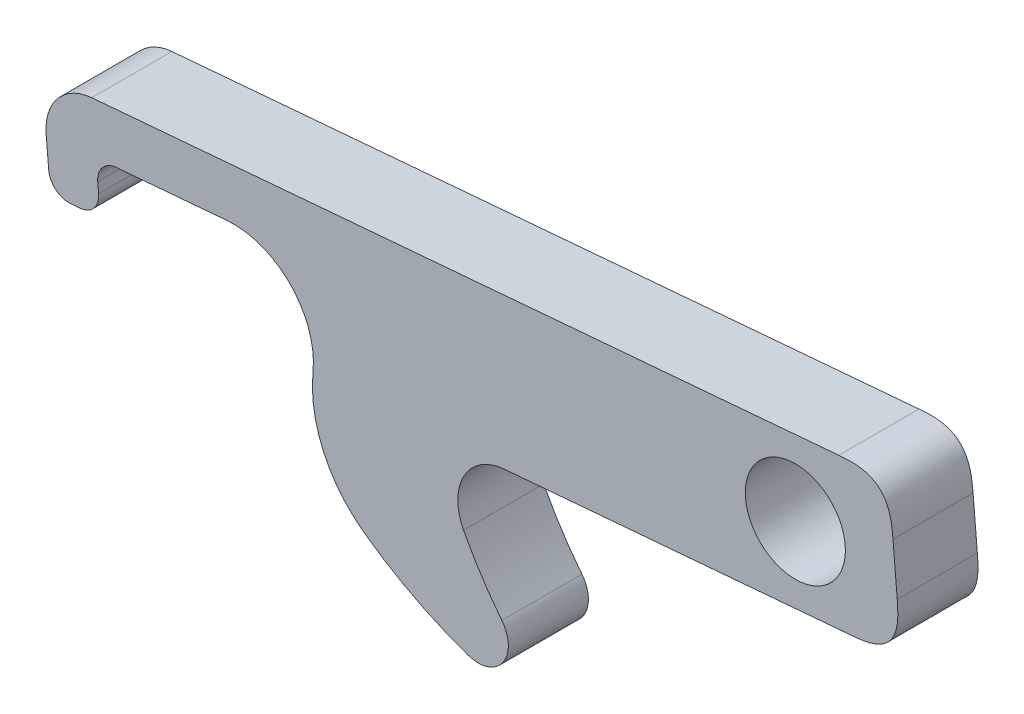
ISO-10303-21;
HEADER;
FILE_DESCRIPTION(('STEP AP214'),'2;1');
FILE_NAME('part.step','',(''),(''),'','','');
FILE_SCHEMA(('AUTOMOTIVE_DESIGN { 1 0 10303 214 1 1 1 1 }'));
ENDSEC;
DATA;
#1=APPLICATION_CONTEXT('core data for automotive mechanical design processes');
#2=APPLICATION_PROTOCOL_DEFINITION('international standard','automotive_design',2000,#1);
#3=PRODUCT_CONTEXT('',#1,'mechanical');
#4=PRODUCT('Part','Part','',(#3));
#5=PRODUCT_RELATED_PRODUCT_CATEGORY('part','',(#4));
#6=PRODUCT_DEFINITION_FORMATION('','',#4);
#7=PRODUCT_DEFINITION_CONTEXT('part definition',#1,'design');
#8=PRODUCT_DEFINITION('design','',#6,#7);
#9=PRODUCT_DEFINITION_SHAPE('','',#8);
#10=(LENGTH_UNIT() NAMED_UNIT(*) SI_UNIT(.MILLI.,.METRE.));
#11=(NAMED_UNIT(*) PLANE_ANGLE_UNIT() SI_UNIT($,.RADIAN.));
#12=(NAMED_UNIT(*) SI_UNIT($,.STERADIAN.) SOLID_ANGLE_UNIT());
#13=UNCERTAINTY_MEASURE_WITH_UNIT(LENGTH_MEASURE(1.E-05),#10,'distance_accuracy_value','');
#14=(GEOMETRIC_REPRESENTATION_CONTEXT(3) GLOBAL_UNCERTAINTY_ASSIGNED_CONTEXT((#13)) GLOBAL_UNIT_ASSIGNED_CONTEXT((#10,
#11,#12)) REPRESENTATION_CONTEXT('',''));
#15=CARTESIAN_POINT('',(0.,0.,0.));
#16=DIRECTION('',(0.,0.,1.));
#17=DIRECTION('',(1.,0.,0.));
#18=AXIS2_PLACEMENT_3D('',#15,#16,#17);
#19=CARTESIAN_POINT('',(-28.7078,-15.,-8.00000000000001));
#20=DIRECTION('',(0.,0.,1.));
#21=DIRECTION('',(1.,0.,0.));
#22=AXIS2_PLACEMENT_3D('',#19,#20,#21);
#23=CYLINDRICAL_SURFACE('',#22,5.);
#24=CARTESIAN_POINT('',(-28.7078,-15.,0.));
#25=DIRECTION('',(0.,0.,-1.));
#26=DIRECTION('',(1.,0.,0.));
#27=AXIS2_PLACEMENT_3D('',#24,#25,#26);
#28=CIRCLE('',#27,5.);
#29=CARTESIAN_POINT('',(-33.1393295835851,-17.3155011444199,0.));
#30=VERTEX_POINT('',#29);
#31=CARTESIAN_POINT('',(-29.1337255559148,-10.018174288394,0.));
#32=VERTEX_POINT('',#31);
#33=EDGE_CURVE('E468',#30,#32,#28,.T.);
#34=ORIENTED_EDGE('',*,*,#33,.F.);
#35=DIRECTION('',(0.,0.,1.));
#36=VECTOR('',#35,1.);
#37=CARTESIAN_POINT('',(-33.1393295835851,-17.3155011444198,-8.00000000000001));
#38=LINE('',#37,#36);
#39=CARTESIAN_POINT('',(-33.1393295835851,-17.3155011444198,-8.00000000000001));
#40=VERTEX_POINT('',#39);
#41=EDGE_CURVE('E204',#40,#30,#38,.T.);
#42=ORIENTED_EDGE('',*,*,#41,.F.);
#43=CARTESIAN_POINT('',(-28.7078,-15.,-8.00000000000001));
#44=DIRECTION('',(0.,0.,-1.));
#45=DIRECTION('',(1.,0.,0.));
#46=AXIS2_PLACEMENT_3D('',#43,#44,#45);
#47=CIRCLE('',#46,5.);
#48=CARTESIAN_POINT('',(-29.1337255559148,-10.018174288394,-7.99999999999995));
#49=VERTEX_POINT('',#48);
#50=EDGE_CURVE('E195',#40,#49,#47,.T.);
#51=ORIENTED_EDGE('',*,*,#50,.T.);
#52=DIRECTION('',(0.,0.,1.));
#53=VECTOR('',#52,1.);
#54=CARTESIAN_POINT('',(-29.1337255559148,-10.018174288394,-7.99999999999995));
#55=LINE('',#54,#53);
#56=EDGE_CURVE('E174',#49,#32,#55,.T.);
#57=ORIENTED_EDGE('',*,*,#56,.T.);
#58=EDGE_LOOP('',(#34,#42,#51,#57));
#59=FACE_BOUND('',#58,.T.);
#60=ADVANCED_FACE('F44',(#59),#23,.F.);
#61=CARTESIAN_POINT('',(0.,0.,-8.00000000000001));
#62=DIRECTION('',(0.,0.,1.));
#63=DIRECTION('',(1.,0.,0.));
#64=AXIS2_PLACEMENT_3D('',#61,#62,#63);
#65=CYLINDRICAL_SURFACE('',#64,37.3903964291887);
#66=CARTESIAN_POINT('',(0.,0.,0.));
#67=DIRECTION('',(0.,0.,-1.));
#68=DIRECTION('',(1.,0.,0.));
#69=AXIS2_PLACEMENT_3D('',#66,#67,#68);
#70=CIRCLE('',#69,37.3903964291887);
#71=CARTESIAN_POINT('',(-29.3122779694776,-23.2127573840758,0.));
#72=VERTEX_POINT('',#71);
#73=EDGE_CURVE('E206',#72,#30,#70,.T.);
#74=ORIENTED_EDGE('',*,*,#73,.F.);
#75=DIRECTION('',(0.,0.,1.));
#76=VECTOR('',#75,1.);
#77=CARTESIAN_POINT('',(-29.3122779694776,-23.2127573840758,-8.00000000000001));
#78=LINE('',#77,#76);
#79=CARTESIAN_POINT('',(-29.3122779694776,-23.2127573840758,-8.00000000000001));
#80=VERTEX_POINT('',#79);
#81=EDGE_CURVE('E429',#80,#72,#78,.T.);
#82=ORIENTED_EDGE('',*,*,#81,.F.);
#83=CARTESIAN_POINT('',(0.,0.,-8.00000000000001));
#84=DIRECTION('',(0.,0.,-1.));
#85=DIRECTION('',(1.,0.,0.));
#86=AXIS2_PLACEMENT_3D('',#83,#84,#85);
#87=CIRCLE('',#86,37.3903964291887);
#88=EDGE_CURVE('E188',#80,#40,#87,.T.);
#89=ORIENTED_EDGE('',*,*,#88,.T.);
#90=ORIENTED_EDGE('',*,*,#41,.T.);
#91=EDGE_LOOP('',(#74,#82,#89,#90));
#92=FACE_BOUND('',#91,.T.);
#93=ADVANCED_FACE('F247',(#92),#65,.F.);
#94=CARTESIAN_POINT('',(-31.6641341225668,-25.0752215139791,-8.00000000000001));
#95=DIRECTION('',(0.,0.,1.));
#96=DIRECTION('',(1.,0.,0.));
#97=AXIS2_PLACEMENT_3D('',#94,#95,#96);
#98=CYLINDRICAL_SURFACE('',#97,3.);
#99=CARTESIAN_POINT('',(-31.6641341225668,-25.0752215139791,0.));
#100=DIRECTION('',(0.,0.,1.));
#101=DIRECTION('',(1.,0.,0.));
#102=AXIS2_PLACEMENT_3D('',#99,#100,#101);
#103=CIRCLE('',#102,3.);
#104=CARTESIAN_POINT('',(-32.6413980189783,-27.9115845508223,0.));
#105=VERTEX_POINT('',#104);
#106=EDGE_CURVE('E211',#105,#72,#103,.T.);
#107=ORIENTED_EDGE('',*,*,#106,.F.);
#108=DIRECTION('',(0.,0.,1.));
#109=VECTOR('',#108,1.);
#110=CARTESIAN_POINT('',(-32.6413980189783,-27.9115845508223,-8.00000000000001));
#111=LINE('',#110,#109);
#112=CARTESIAN_POINT('',(-32.6413980189783,-27.9115845508223,-8.00000000000001));
#113=VERTEX_POINT('',#112);
#114=EDGE_CURVE('E433',#113,#105,#111,.T.);
#115=ORIENTED_EDGE('',*,*,#114,.F.);
#116=CARTESIAN_POINT('',(-31.6641341225668,-25.0752215139791,-8.00000000000001));
#117=DIRECTION('',(0.,0.,1.));
#118=DIRECTION('',(1.,0.,0.));
#119=AXIS2_PLACEMENT_3D('',#116,#117,#118);
#120=CIRCLE('',#119,3.);
#121=EDGE_CURVE('E444',#113,#80,#120,.T.);
#122=ORIENTED_EDGE('',*,*,#121,.T.);
#123=ORIENTED_EDGE('',*,*,#81,.T.);
#124=EDGE_LOOP('',(#107,#115,#122,#123));
#125=FACE_BOUND('',#124,.T.);
#126=ADVANCED_FACE('F627',(#125),#98,.T.);
#127=CARTESIAN_POINT('',(-19.611212733492,9.90658927375435,-8.00000000000001));
#128=DIRECTION('',(0.,0.,1.));
#129=DIRECTION('',(1.,0.,0.));
#130=AXIS2_PLACEMENT_3D('',#127,#128,#129);
#131=CYLINDRICAL_SURFACE('',#130,40.);
#132=CARTESIAN_POINT('',(-19.611212733492,9.90658927375435,0.));
#133=DIRECTION('',(0.,0.,1.));
#134=DIRECTION('',(1.,0.,0.));
#135=AXIS2_PLACEMENT_3D('',#132,#133,#134);
#136=CIRCLE('',#135,40.);
#137=CARTESIAN_POINT('',(-43.0603085295121,-22.4992729482121,0.));
#138=VERTEX_POINT('',#137);
#139=EDGE_CURVE('E525',#138,#105,#136,.T.);
#140=ORIENTED_EDGE('',*,*,#139,.F.);
#141=DIRECTION('',(0.,0.,1.));
#142=VECTOR('',#141,1.);
#143=CARTESIAN_POINT('',(-43.0603085295122,-22.499272948212,-8.00000000000001));
#144=LINE('',#143,#142);
#145=CARTESIAN_POINT('',(-43.0603085295122,-22.499272948212,-8.00000000000001));
#146=VERTEX_POINT('',#145);
#147=EDGE_CURVE('E187',#146,#138,#144,.T.);
#148=ORIENTED_EDGE('',*,*,#147,.F.);
#149=CARTESIAN_POINT('',(-19.611212733492,9.90658927375435,-8.00000000000001));
#150=DIRECTION('',(0.,0.,1.));
#151=DIRECTION('',(1.,0.,0.));
#152=AXIS2_PLACEMENT_3D('',#149,#150,#151);
#153=CIRCLE('',#152,40.);
#154=EDGE_CURVE('E449',#146,#113,#153,.T.);
#155=ORIENTED_EDGE('',*,*,#154,.T.);
#156=ORIENTED_EDGE('',*,*,#114,.T.);
#157=EDGE_LOOP('',(#140,#148,#155,#156));
#158=FACE_BOUND('',#157,.T.);
#159=ADVANCED_FACE('F625',(#158),#131,.T.);
#160=CARTESIAN_POINT('',(-35.7324660932558,-12.3724410038475,-7.99999999999995));
#161=DIRECTION('',(0.,0.,1.));
#162=DIRECTION('',(1.,0.,0.));
#163=AXIS2_PLACEMENT_3D('',#160,#161,#162);
#164=CYLINDRICAL_SURFACE('',#163,12.5);
#165=CARTESIAN_POINT('',(-35.7324660932558,-12.3724410038476,0.));
#166=DIRECTION('',(0.,0.,1.));
#167=DIRECTION('',(1.,0.,0.));
#168=AXIS2_PLACEMENT_3D('',#165,#166,#167);
#169=CIRCLE('',#168,12.5);
#170=CARTESIAN_POINT('',(-48.1695914210683,-11.1202774441292,0.));
#171=VERTEX_POINT('',#170);
#172=EDGE_CURVE('E477',#171,#138,#169,.T.);
#173=ORIENTED_EDGE('',*,*,#172,.F.);
#174=DIRECTION('',(0.,0.,1.));
#175=VECTOR('',#174,1.);
#176=CARTESIAN_POINT('',(-48.1695914210683,-11.1202774441293,-8.00000000000001));
#177=LINE('',#176,#175);
#178=CARTESIAN_POINT('',(-48.1695914210683,-11.1202774441293,-8.00000000000001));
#179=VERTEX_POINT('',#178);
#180=EDGE_CURVE('E60',#171,#179,#177,.F.);
#181=ORIENTED_EDGE('',*,*,#180,.T.);
#182=CARTESIAN_POINT('',(-35.7324660932558,-12.3724410038475,-7.99999999999995));
#183=DIRECTION('',(0.,0.,1.));
#184=DIRECTION('',(1.,0.,0.));
#185=AXIS2_PLACEMENT_3D('',#182,#183,#184);
#186=CIRCLE('',#185,12.5);
#187=EDGE_CURVE('E454',#179,#146,#186,.T.);
#188=ORIENTED_EDGE('',*,*,#187,.T.);
#189=ORIENTED_EDGE('',*,*,#147,.T.);
#190=EDGE_LOOP('',(#173,#181,#188,#189));
#191=FACE_BOUND('',#190,.T.);
#192=ADVANCED_FACE('F622',(#191),#164,.T.);
#193=CARTESIAN_POINT('',(9.32476308933986,8.32458967923855,-7.99999999999995));
#194=DIRECTION('',(-0.0851851111829553,0.996365142321201,0.));
#195=DIRECTION('',(-0.996365142321201,-0.0851851111829553,0.));
#196=AXIS2_PLACEMENT_3D('',#193,#194,#195);
#197=PLANE('',#196);
#198=DIRECTION('',(-0.996365142321201,-0.0851851111829553,0.));
#199=VECTOR('',#198,1.);
#200=CARTESIAN_POINT('',(9.32476308933986,8.32458967923855,-7.99999999999995));
#201=LINE('',#200,#199);
#202=CARTESIAN_POINT('',(4.34293737773385,7.8986641233238,-7.99999999999995));
#203=VERTEX_POINT('',#202);
#204=CARTESIAN_POINT('',(-70.2661079165071,1.5198983991058,-8.00000000000001));
#205=VERTEX_POINT('',#204);
#206=EDGE_CURVE('E458',#203,#205,#201,.T.);
#207=ORIENTED_EDGE('',*,*,#206,.T.);
#208=DIRECTION('',(0.,0.,1.));
#209=VECTOR('',#208,1.);
#210=CARTESIAN_POINT('',(-70.2661079165071,1.5198983991058,-8.00000000000001));
#211=LINE('',#210,#209);
#212=CARTESIAN_POINT('',(-70.2661079165071,1.5198983991058,0.));
#213=VERTEX_POINT('',#212);
#214=EDGE_CURVE('E342',#205,#213,#211,.T.);
#215=ORIENTED_EDGE('',*,*,#214,.T.);
#216=DIRECTION('',(-0.996365142321201,-0.0851851111829553,0.));
#217=VECTOR('',#216,1.);
#218=CARTESIAN_POINT('',(9.32476308933986,8.32458967923855,0.));
#219=LINE('',#218,#217);
#220=CARTESIAN_POINT('',(4.34293737773385,7.8986641233238,0.));
#221=VERTEX_POINT('',#220);
#222=EDGE_CURVE('E473',#221,#213,#219,.T.);
#223=ORIENTED_EDGE('',*,*,#222,.F.);
#224=CARTESIAN_POINT('',(4.34293737773385,7.89866412332382,-8.39999999999991));
#225=CARTESIAN_POINT('',(4.34293737773385,7.89866412332385,-5.46666666666884));
#226=CARTESIAN_POINT('',(4.34293737773385,7.8986641233238,-2.53333333333328));
#227=CARTESIAN_POINT('',(4.34293737773385,7.8986641233238,0.400000000000067));
#228=B_SPLINE_CURVE_WITH_KNOTS('',3,(#224,#225,#226,#227),.UNSPECIFIED.,.F.,.F.,(4,4),(-0.0004,
0.0084),.UNSPECIFIED.);
#229=EDGE_CURVE('E338',#221,#203,#228,.F.);
#230=ORIENTED_EDGE('',*,*,#229,.T.);
#231=EDGE_LOOP('',(#207,#215,#223,#230));
#232=FACE_BOUND('',#231,.T.);
#233=ADVANCED_FACE('F613',(#232),#197,.T.);
#234=CARTESIAN_POINT('',(10.6025397570842,-6.62088745557943,-7.99999999999995));
#235=DIRECTION('',(0.996365142321201,0.0851851111829548,0.));
#236=DIRECTION('',(-0.0851851111829548,0.996365142321201,0.));
#237=AXIS2_PLACEMENT_3D('',#234,#235,#236);
#238=PLANE('',#237);
#239=DIRECTION('',(-0.0851851111829548,0.996365142321201,0.));
#240=VECTOR('',#239,1.);
#241=CARTESIAN_POINT('',(10.6025397570842,-6.62088745557945,0.));
#242=LINE('',#241,#240);
#243=CARTESIAN_POINT('',(10.1766142011694,-1.63906174397346,0.));
#244=VERTEX_POINT('',#243);
#245=CARTESIAN_POINT('',(9.75068864525464,3.34276396763256,0.));
#246=VERTEX_POINT('',#245);
#247=EDGE_CURVE('E230',#244,#246,#242,.T.);
#248=ORIENTED_EDGE('',*,*,#247,.F.);
#249=CARTESIAN_POINT('',(10.1766142011694,-1.63906174397346,-8.39999999999996));
#250=CARTESIAN_POINT('',(10.1766142011694,-1.63906174397344,-5.4666666666689));
#251=CARTESIAN_POINT('',(10.1766142011694,-1.63906174397346,-2.53333333333333));
#252=CARTESIAN_POINT('',(10.1766142011694,-1.63906174397346,0.400000000000011));
#253=B_SPLINE_CURVE_WITH_KNOTS('',3,(#249,#250,#251,#252),.UNSPECIFIED.,.F.,.F.,(4,4),(-0.0004,
0.0084),.UNSPECIFIED.);
#254=CARTESIAN_POINT('',(10.1766142011694,-1.63906174397346,-8.00000000000001));
#255=VERTEX_POINT('',#254);
#256=EDGE_CURVE('E293',#244,#255,#253,.F.);
#257=ORIENTED_EDGE('',*,*,#256,.T.);
#258=DIRECTION('',(-0.0851851111829548,0.996365142321201,0.));
#259=VECTOR('',#258,1.);
#260=CARTESIAN_POINT('',(10.6025397570842,-6.62088745557943,-7.99999999999995));
#261=LINE('',#260,#259);
#262=CARTESIAN_POINT('',(9.75068864525463,3.34276396763258,-8.00000000000001));
#263=VERTEX_POINT('',#262);
#264=EDGE_CURVE('E202',#255,#263,#261,.T.);
#265=ORIENTED_EDGE('',*,*,#264,.T.);
#266=CARTESIAN_POINT('',(9.75068864525463,3.34276396763258,0.400000000000011));
#267=CARTESIAN_POINT('',(9.75068864525463,3.34276396763258,-2.53333333333333));
#268=CARTESIAN_POINT('',(9.75068864525463,3.34276396763261,-5.4666666666689));
#269=CARTESIAN_POINT('',(9.75068864525463,3.34276396763258,-8.40000000000002));
#270=B_SPLINE_CURVE_WITH_KNOTS('',3,(#266,#267,#268,#269),.UNSPECIFIED.,.F.,.F.,(4,4),
(-0.000399999999999999,0.0084),.UNSPECIFIED.);
#271=EDGE_CURVE('E318',#263,#246,#270,.F.);
#272=ORIENTED_EDGE('',*,*,#271,.T.);
#273=EDGE_LOOP('',(#248,#257,#265,#272));
#274=FACE_BOUND('',#273,.T.);
#275=ADVANCED_FACE('F242',(#274),#238,.T.);
#276=CARTESIAN_POINT('',(-29.1337255559148,-10.018174288394,-7.99999999999995));
#277=DIRECTION('',(0.0851851111829544,-0.996365142321201,0.));
#278=DIRECTION('',(0.996365142321201,0.0851851111829544,0.));
#279=AXIS2_PLACEMENT_3D('',#276,#277,#278);
#280=PLANE('',#279);
#281=DIRECTION('',(0.996365142321201,0.0851851111829544,0.));
#282=VECTOR('',#281,1.);
#283=CARTESIAN_POINT('',(-29.1337255559148,-10.018174288394,-7.99999999999995));
#284=LINE('',#283,#282);
#285=CARTESIAN_POINT('',(5.62071404547816,-7.04681301149426,-7.99999999999995));
#286=VERTEX_POINT('',#285);
#287=EDGE_CURVE('E178',#49,#286,#284,.T.);
#288=ORIENTED_EDGE('',*,*,#287,.T.);
#289=CARTESIAN_POINT('',(5.62071404547817,-7.04681301149424,0.400000000000067));
#290=CARTESIAN_POINT('',(5.62071404547817,-7.04681301149424,-2.53333333333328));
#291=CARTESIAN_POINT('',(5.62071404547818,-7.04681301149421,-5.46666666666884));
#292=CARTESIAN_POINT('',(5.62071404547817,-7.04681301149426,-8.39999999999991));
#293=B_SPLINE_CURVE_WITH_KNOTS('',3,(#289,#290,#291,#292),.UNSPECIFIED.,.F.,.F.,(4,4),
(-0.000399999999999999,0.0084),.UNSPECIFIED.);
#294=CARTESIAN_POINT('',(5.62071404547816,-7.04681301149424,0.));
#295=VERTEX_POINT('',#294);
#296=EDGE_CURVE('E225',#286,#295,#293,.F.);
#297=ORIENTED_EDGE('',*,*,#296,.T.);
#298=DIRECTION('',(0.996365142321201,0.0851851111829544,0.));
#299=VECTOR('',#298,1.);
#300=CARTESIAN_POINT('',(-29.1337255559148,-10.018174288394,0.));
#301=LINE('',#300,#299);
#302=EDGE_CURVE('E181',#32,#295,#301,.T.);
#303=ORIENTED_EDGE('',*,*,#302,.F.);
#304=ORIENTED_EDGE('',*,*,#56,.F.);
#305=EDGE_LOOP('',(#288,#297,#303,#304));
#306=FACE_BOUND('',#305,.T.);
#307=ADVANCED_FACE('F176',(#306),#280,.T.);
#308=CARTESIAN_POINT('',(-28.7078,-15.,-8.00000000000001));
#309=DIRECTION('',(0.,0.,1.));
#310=DIRECTION('',(1.,0.,0.));
#311=AXIS2_PLACEMENT_3D('',#308,#309,#310);
#312=PLANE('',#311);
#313=CARTESIAN_POINT('',(0.,0.,-8.00000000000001));
#314=DIRECTION('',(0.,0.,1.));
#315=DIRECTION('',(1.,0.,0.));
#316=AXIS2_PLACEMENT_3D('',#313,#314,#315);
#317=CIRCLE('',#316,5.);
#318=CARTESIAN_POINT('',(5.,0.,-8.00000000000001));
#319=VERTEX_POINT('',#318);
#320=EDGE_CURVE('E471',#319,#319,#317,.T.);
#321=ORIENTED_EDGE('',*,*,#320,.T.);
#322=EDGE_LOOP('',(#321));
#323=FACE_BOUND('',#322,.T.);
#324=DIRECTION('',(0.0851851111829561,-0.996365142321201,0.));
#325=VECTOR('',#324,1.);
#326=CARTESIAN_POINT('',(-69.4142568046775,-8.44375302410621,-8.00000000000001));
#327=LINE('',#326,#325);
#328=CARTESIAN_POINT('',(-69.6698121382264,-5.45465759714264,-8.00000000000001));
#329=VERTEX_POINT('',#328);
#330=CARTESIAN_POINT('',(-69.5846270270435,-6.45102273946382,-7.99999999999995));
#331=VERTEX_POINT('',#330);
#332=EDGE_CURVE('E492',#329,#331,#327,.T.);
#333=ORIENTED_EDGE('',*,*,#332,.T.);
#334=CARTESIAN_POINT('',(-71.5773573116859,-6.6213929618297,-8.00000000000001));
#335=DIRECTION('',(0.,0.,1.));
#336=DIRECTION('',(1.,0.,0.));
#337=AXIS2_PLACEMENT_3D('',#334,#335,#336);
#338=CIRCLE('',#337,2.);
#339=CARTESIAN_POINT('',(-71.40698708932,-8.61412324647212,-7.99999999999995));
#340=VERTEX_POINT('',#339);
#341=EDGE_CURVE('E388',#331,#340,#338,.F.);
#342=ORIENTED_EDGE('',*,*,#341,.T.);
#343=DIRECTION('',(-0.996365142321201,-0.085185111182956,0.));
#344=VECTOR('',#343,1.);
#345=CARTESIAN_POINT('',(-74.3960825162835,-8.86967858002097,-7.99999999999995));
#346=LINE('',#345,#344);
#347=CARTESIAN_POINT('',(-72.4033522316412,-8.69930835765512,-8.00000000000001));
#348=VERTEX_POINT('',#347);
#349=EDGE_CURVE('E496',#340,#348,#346,.T.);
#350=ORIENTED_EDGE('',*,*,#349,.T.);
#351=CARTESIAN_POINT('',(-72.573722454007,-6.70657807301267,-8.00000000000001));
#352=DIRECTION('',(0.,0.,1.));
#353=DIRECTION('',(1.,0.,0.));
#354=AXIS2_PLACEMENT_3D('',#351,#352,#353);
#355=CIRCLE('',#354,2.);
#356=CARTESIAN_POINT('',(-74.5664527386494,-6.87694829537858,-8.00000000000001));
#357=VERTEX_POINT('',#356);
#358=EDGE_CURVE('E385',#348,#357,#355,.F.);
#359=ORIENTED_EDGE('',*,*,#358,.T.);
#360=DIRECTION('',(-0.085185111182956,0.996365142321201,0.));
#361=VECTOR('',#360,1.);
#362=CARTESIAN_POINT('',(-75.2479336281131,1.09397284319104,-7.99999999999995));
#363=LINE('',#362,#361);
#364=CARTESIAN_POINT('',(-74.8220080721984,-3.88785286841498,-8.00000000000001));
#365=VERTEX_POINT('',#364);
#366=EDGE_CURVE('E501',#357,#365,#363,.T.);
#367=ORIENTED_EDGE('',*,*,#366,.T.);
#368=CARTESIAN_POINT('',(-69.8401823605924,-3.46192731250025,-8.00000000000001));
#369=DIRECTION('',(0.,0.,1.));
#370=DIRECTION('',(1.,0.,0.));
#371=AXIS2_PLACEMENT_3D('',#368,#369,#370);
#372=CIRCLE('',#371,5.);
#373=EDGE_CURVE('E358',#365,#205,#372,.F.);
#374=ORIENTED_EDGE('',*,*,#373,.T.);
#375=ORIENTED_EDGE('',*,*,#206,.F.);
#376=CARTESIAN_POINT('',(9.75068864525464,3.34276396763259,-8.00000000000002));
#377=CARTESIAN_POINT('',(9.67904879665125,4.18069734540639,-8.00000000000002));
#378=CARTESIAN_POINT('',(9.60740894804787,5.01863072318026,-8.00000000000002));
#379=CARTESIAN_POINT('',(9.09235714683285,6.83491129018788,-7.99999999999992));
#380=CARTESIAN_POINT('',(7.89615554191074,7.84268232263799,-8.00000000000002));
#381=CARTESIAN_POINT('',(6.01880413328154,8.04194382053053,-8.00000000000002));
#382=CARTESIAN_POINT('',(5.1808707555077,7.97030397192717,-8.00000000000002));
#383=CARTESIAN_POINT('',(4.34293737773385,7.89866412332383,-7.99999999999992));
#384=B_SPLINE_CURVE_WITH_KNOTS('',5,(#376,#377,#378,#379,#380,#381,#382,#383),.UNSPECIFIED.,.F.,
.F.,(6,2,6),(0.,0.5,1.),.UNSPECIFIED.);
#385=EDGE_CURVE('E328',#203,#263,#384,.F.);
#386=ORIENTED_EDGE('',*,*,#385,.T.);
#387=ORIENTED_EDGE('',*,*,#264,.F.);
#388=CARTESIAN_POINT('',(5.62071404547817,-7.04681301149426,-7.99999999999991));
#389=CARTESIAN_POINT('',(6.45864742325202,-6.97517316289081,-8.00000000000002));
#390=CARTESIAN_POINT('',(7.29658080102586,-6.9035333142875,-8.00000000000002));
#391=CARTESIAN_POINT('',(9.1128613680335,-6.38848151307247,-8.00000000000002));
#392=CARTESIAN_POINT('',(10.1206324004836,-5.1922799081503,-8.00000000000002));
#393=CARTESIAN_POINT('',(10.3198938983762,-3.31492849952117,-8.00000000000002));
#394=CARTESIAN_POINT('',(10.2482540497728,-2.47699512174729,-8.00000000000002));
#395=CARTESIAN_POINT('',(10.1766142011694,-1.63906174397346,-7.99999999999997));
#396=B_SPLINE_CURVE_WITH_KNOTS('',5,(#388,#389,#390,#391,#392,#393,#394,#395),.UNSPECIFIED.,.F.,
.F.,(6,2,6),(0.,0.5,1.),.UNSPECIFIED.);
#397=EDGE_CURVE('E199',#255,#286,#396,.F.);
#398=ORIENTED_EDGE('',*,*,#397,.T.);
#399=ORIENTED_EDGE('',*,*,#287,.F.);
#400=ORIENTED_EDGE('',*,*,#50,.F.);
#401=ORIENTED_EDGE('',*,*,#88,.F.);
#402=ORIENTED_EDGE('',*,*,#121,.F.);
#403=ORIENTED_EDGE('',*,*,#154,.F.);
#404=ORIENTED_EDGE('',*,*,#187,.F.);
#405=CARTESIAN_POINT('',(-56.1293516308682,-10.3188927659096,-8.00000000000001));
#406=DIRECTION('',(0.,0.,1.));
#407=DIRECTION('',(1.,0.,0.));
#408=AXIS2_PLACEMENT_3D('',#405,#406,#407);
#409=CIRCLE('',#408,8.);
#410=CARTESIAN_POINT('',(-56.8108325203319,-2.34797162733996,-8.00000000000001));
#411=VERTEX_POINT('',#410);
#412=EDGE_CURVE('E11',#179,#411,#409,.T.);
#413=ORIENTED_EDGE('',*,*,#412,.T.);
#414=DIRECTION('',(-0.996365142321201,-0.0851851111829558,0.));
#415=VECTOR('',#414,1.);
#416=CARTESIAN_POINT('',(-69.8401823605923,-3.46192731250025,-8.00000000000001));
#417=LINE('',#416,#415);
#418=CARTESIAN_POINT('',(-67.8474520759499,-3.29155709013426,-8.00000000000001));
#419=VERTEX_POINT('',#418);
#420=EDGE_CURVE('E489',#411,#419,#417,.T.);
#421=ORIENTED_EDGE('',*,*,#420,.T.);
#422=CARTESIAN_POINT('',(-67.677081853584,-5.28428737477665,-7.99999999999995));
#423=DIRECTION('',(0.,0.,1.));
#424=DIRECTION('',(1.,0.,0.));
#425=AXIS2_PLACEMENT_3D('',#422,#423,#424);
#426=CIRCLE('',#425,2.);
#427=EDGE_CURVE('E398',#419,#329,#426,.T.);
#428=ORIENTED_EDGE('',*,*,#427,.T.);
#429=EDGE_LOOP('',(#333,#342,#350,#359,#367,#374,#375,#386,#387,#398,#399,#400,#401,#402,#403,
#404,#413,#421,#428));
#430=FACE_BOUND('',#429,.T.);
#431=ADVANCED_FACE('F193',(#323,#430),#312,.F.);
#432=CARTESIAN_POINT('',(-28.7078,-15.,0.));
#433=DIRECTION('',(0.,0.,1.));
#434=DIRECTION('',(1.,0.,0.));
#435=AXIS2_PLACEMENT_3D('',#432,#433,#434);
#436=PLANE('',#435);
#437=DIRECTION('',(0.996365142321201,0.085185111182956,0.));
#438=VECTOR('',#437,1.);
#439=CARTESIAN_POINT('',(-74.3960825162836,-8.869678580021,0.));
#440=LINE('',#439,#438);
#441=CARTESIAN_POINT('',(-72.4033522316412,-8.69930835765509,0.));
#442=VERTEX_POINT('',#441);
#443=CARTESIAN_POINT('',(-71.40698708932,-8.61412324647209,0.));
#444=VERTEX_POINT('',#443);
#445=EDGE_CURVE('E514',#442,#444,#440,.T.);
#446=ORIENTED_EDGE('',*,*,#445,.T.);
#447=CARTESIAN_POINT('',(-71.5773573116859,-6.62139296182968,0.));
#448=DIRECTION('',(0.,0.,1.));
#449=DIRECTION('',(1.,0.,0.));
#450=AXIS2_PLACEMENT_3D('',#447,#448,#449);
#451=CIRCLE('',#450,2.);
#452=CARTESIAN_POINT('',(-69.5846270270435,-6.45102273946382,0.));
#453=VERTEX_POINT('',#452);
#454=EDGE_CURVE('E382',#444,#453,#451,.T.);
#455=ORIENTED_EDGE('',*,*,#454,.T.);
#456=DIRECTION('',(-0.0851851111829561,0.996365142321201,0.));
#457=VECTOR('',#456,1.);
#458=CARTESIAN_POINT('',(-69.4142568046776,-8.44375302410621,0.));
#459=LINE('',#458,#457);
#460=CARTESIAN_POINT('',(-69.6698121382265,-5.45465759714261,0.));
#461=VERTEX_POINT('',#460);
#462=EDGE_CURVE('E509',#453,#461,#459,.T.);
#463=ORIENTED_EDGE('',*,*,#462,.T.);
#464=CARTESIAN_POINT('',(-67.677081853584,-5.28428737477668,0.));
#465=DIRECTION('',(0.,0.,1.));
#466=DIRECTION('',(1.,0.,0.));
#467=AXIS2_PLACEMENT_3D('',#464,#465,#466);
#468=CIRCLE('',#467,2.);
#469=CARTESIAN_POINT('',(-67.8474520759499,-3.29155709013426,0.));
#470=VERTEX_POINT('',#469);
#471=EDGE_CURVE('E395',#461,#470,#468,.F.);
#472=ORIENTED_EDGE('',*,*,#471,.T.);
#473=DIRECTION('',(0.996365142321201,0.0851851111829558,0.));
#474=VECTOR('',#473,1.);
#475=CARTESIAN_POINT('',(-69.8401823605924,-3.46192731250022,0.));
#476=LINE('',#475,#474);
#477=CARTESIAN_POINT('',(-56.8108325203319,-2.34797162733996,0.));
#478=VERTEX_POINT('',#477);
#479=EDGE_CURVE('E505',#470,#478,#476,.T.);
#480=ORIENTED_EDGE('',*,*,#479,.T.);
#481=CARTESIAN_POINT('',(-56.1293516308682,-10.3188927659096,0.));
#482=DIRECTION('',(0.,0.,1.));
#483=DIRECTION('',(1.,0.,0.));
#484=AXIS2_PLACEMENT_3D('',#481,#482,#483);
#485=CIRCLE('',#484,8.);
#486=EDGE_CURVE('E53',#478,#171,#485,.F.);
#487=ORIENTED_EDGE('',*,*,#486,.T.);
#488=ORIENTED_EDGE('',*,*,#172,.T.);
#489=ORIENTED_EDGE('',*,*,#139,.T.);
#490=ORIENTED_EDGE('',*,*,#106,.T.);
#491=ORIENTED_EDGE('',*,*,#73,.T.);
#492=ORIENTED_EDGE('',*,*,#33,.T.);
#493=ORIENTED_EDGE('',*,*,#302,.T.);
#494=CARTESIAN_POINT('',(10.1766142011694,-1.63906174397346,0.));
#495=CARTESIAN_POINT('',(10.2482540497728,-2.47699512174729,0.));
#496=CARTESIAN_POINT('',(10.3198938983762,-3.31492849952114,0.));
#497=CARTESIAN_POINT('',(10.1206324004836,-5.1922799081503,0.));
#498=CARTESIAN_POINT('',(9.1128613680335,-6.38848151307245,0.));
#499=CARTESIAN_POINT('',(7.29658080102586,-6.9035333142875,0.));
#500=CARTESIAN_POINT('',(6.45864742325201,-6.97517316289081,0.));
#501=CARTESIAN_POINT('',(5.62071404547817,-7.04681301149424,0.));
#502=B_SPLINE_CURVE_WITH_KNOTS('',5,(#494,#495,#496,#497,#498,#499,#500,#501),.UNSPECIFIED.,.F.,
.F.,(6,2,6),(0.,0.5,1.),.UNSPECIFIED.);
#503=EDGE_CURVE('E420',#295,#244,#502,.F.);
#504=ORIENTED_EDGE('',*,*,#503,.T.);
#505=ORIENTED_EDGE('',*,*,#247,.T.);
#506=CARTESIAN_POINT('',(4.34293737773385,7.8986641233238,0.));
#507=CARTESIAN_POINT('',(5.1808707555077,7.97030397192717,0.));
#508=CARTESIAN_POINT('',(6.01880413328154,8.04194382053053,0.));
#509=CARTESIAN_POINT('',(7.89615554191073,7.84268232263799,0.));
#510=CARTESIAN_POINT('',(9.09235714683285,6.83491129018787,0.));
#511=CARTESIAN_POINT('',(9.60740894804787,5.01863072318025,0.));
#512=CARTESIAN_POINT('',(9.67904879665125,4.18069734540641,0.));
#513=CARTESIAN_POINT('',(9.75068864525463,3.34276396763258,0.));
#514=B_SPLINE_CURVE_WITH_KNOTS('',5,(#506,#507,#508,#509,#510,#511,#512,#513),.UNSPECIFIED.,.F.,
.F.,(6,2,6),(0.,0.5,1.),.UNSPECIFIED.);
#515=EDGE_CURVE('E306',#246,#221,#514,.F.);
#516=ORIENTED_EDGE('',*,*,#515,.T.);
#517=ORIENTED_EDGE('',*,*,#222,.T.);
#518=CARTESIAN_POINT('',(-69.8401823605924,-3.46192731250022,0.));
#519=DIRECTION('',(0.,0.,1.));
#520=DIRECTION('',(1.,0.,0.));
#521=AXIS2_PLACEMENT_3D('',#518,#519,#520);
#522=CIRCLE('',#521,5.);
#523=CARTESIAN_POINT('',(-74.8220080721984,-3.887852868415,0.));
#524=VERTEX_POINT('',#523);
#525=EDGE_CURVE('E351',#213,#524,#522,.T.);
#526=ORIENTED_EDGE('',*,*,#525,.T.);
#527=DIRECTION('',(0.085185111182956,-0.996365142321201,0.));
#528=VECTOR('',#527,1.);
#529=CARTESIAN_POINT('',(-75.2479336281131,1.09397284319107,0.));
#530=LINE('',#529,#528);
#531=CARTESIAN_POINT('',(-74.5664527386495,-6.8769482953786,0.));
#532=VERTEX_POINT('',#531);
#533=EDGE_CURVE('E519',#524,#532,#530,.T.);
#534=ORIENTED_EDGE('',*,*,#533,.T.);
#535=CARTESIAN_POINT('',(-72.5737224540071,-6.70657807301264,0.));
#536=DIRECTION('',(0.,0.,1.));
#537=DIRECTION('',(1.,0.,0.));
#538=AXIS2_PLACEMENT_3D('',#535,#536,#537);
#539=CIRCLE('',#538,2.);
#540=EDGE_CURVE('E379',#532,#442,#539,.T.);
#541=ORIENTED_EDGE('',*,*,#540,.T.);
#542=EDGE_LOOP('',(#446,#455,#463,#472,#480,#487,#488,#489,#490,#491,#492,#493,#504,#505,#516,
#517,#526,#534,#541));
#543=FACE_BOUND('',#542,.T.);
#544=CARTESIAN_POINT('',(0.,0.,0.));
#545=DIRECTION('',(0.,0.,1.));
#546=DIRECTION('',(1.,0.,0.));
#547=AXIS2_PLACEMENT_3D('',#544,#545,#546);
#548=CIRCLE('',#547,5.);
#549=CARTESIAN_POINT('',(5.,0.,0.));
#550=VERTEX_POINT('',#549);
#551=EDGE_CURVE('E215',#550,#550,#548,.T.);
#552=ORIENTED_EDGE('',*,*,#551,.F.);
#553=EDGE_LOOP('',(#552));
#554=FACE_BOUND('',#553,.T.);
#555=ADVANCED_FACE('F547',(#543,#554),#436,.T.);
#556=CARTESIAN_POINT('',(0.,0.,-8.00000000000001));
#557=DIRECTION('',(0.,0.,1.));
#558=DIRECTION('',(1.,0.,0.));
#559=AXIS2_PLACEMENT_3D('',#556,#557,#558);
#560=CYLINDRICAL_SURFACE('',#559,5.);
#561=ORIENTED_EDGE('',*,*,#320,.F.);
#562=EDGE_LOOP('',(#561));
#563=FACE_BOUND('',#562,.T.);
#564=ORIENTED_EDGE('',*,*,#551,.T.);
#565=EDGE_LOOP('',(#564));
#566=FACE_BOUND('',#565,.T.);
#567=ADVANCED_FACE('F259',(#563,#566),#560,.F.);
#568=CARTESIAN_POINT('',(5.62071404547817,-7.04681301149426,-8.39999999999991));
#569=CARTESIAN_POINT('',(5.62071404547818,-7.04681301149421,-5.46666666666884));
#570=CARTESIAN_POINT('',(5.62071404547817,-7.04681301149424,-2.53333333333328));
#571=CARTESIAN_POINT('',(5.62071404547817,-7.04681301149424,0.400000000000067));
#572=CARTESIAN_POINT('',(6.45864742325202,-6.97517316289081,-8.40000000000002));
#573=CARTESIAN_POINT('',(6.45864742325202,-6.97517316289079,-5.4666666666689));
#574=CARTESIAN_POINT('',(6.45864742325201,-6.97517316289081,-2.53333333333333));
#575=CARTESIAN_POINT('',(6.45864742325201,-6.97517316289081,0.400000000000011));
#576=CARTESIAN_POINT('',(7.29658080102586,-6.9035333142875,-8.40000000000002));
#577=CARTESIAN_POINT('',(7.29658080102586,-6.90353331428745,-5.4666666666689));
#578=CARTESIAN_POINT('',(7.29658080102586,-6.90353331428747,-2.53333333333333));
#579=CARTESIAN_POINT('',(7.29658080102586,-6.9035333142875,0.399999999999956));
#580=CARTESIAN_POINT('',(9.1128613680335,-6.38848151307247,-8.40000000000002));
#581=CARTESIAN_POINT('',(9.1128613680335,-6.38848151307245,-5.4666666666689));
#582=CARTESIAN_POINT('',(9.1128613680335,-6.38848151307247,-2.53333333333333));
#583=CARTESIAN_POINT('',(9.1128613680335,-6.38848151307245,0.400000000000011));
#584=CARTESIAN_POINT('',(10.1206324004836,-5.1922799081503,-8.40000000000002));
#585=CARTESIAN_POINT('',(10.1206324004836,-5.19227990815027,-5.4666666666689));
#586=CARTESIAN_POINT('',(10.1206324004836,-5.1922799081503,-2.53333333333333));
#587=CARTESIAN_POINT('',(10.1206324004836,-5.1922799081503,0.400000000000011));
#588=CARTESIAN_POINT('',(10.3198938983762,-3.31492849952117,-8.40000000000002));
#589=CARTESIAN_POINT('',(10.3198938983762,-3.31492849952114,-5.4666666666689));
#590=CARTESIAN_POINT('',(10.3198938983762,-3.31492849952114,-2.53333333333333));
#591=CARTESIAN_POINT('',(10.3198938983762,-3.31492849952114,0.400000000000011));
#592=CARTESIAN_POINT('',(10.2482540497728,-2.47699512174729,-8.40000000000002));
#593=CARTESIAN_POINT('',(10.2482540497728,-2.47699512174726,-5.4666666666689));
#594=CARTESIAN_POINT('',(10.2482540497728,-2.47699512174729,-2.53333333333333));
#595=CARTESIAN_POINT('',(10.2482540497728,-2.47699512174729,0.400000000000011));
#596=CARTESIAN_POINT('',(10.1766142011694,-1.63906174397346,-8.39999999999996));
#597=CARTESIAN_POINT('',(10.1766142011694,-1.63906174397344,-5.4666666666689));
#598=CARTESIAN_POINT('',(10.1766142011694,-1.63906174397346,-2.53333333333333));
#599=CARTESIAN_POINT('',(10.1766142011694,-1.63906174397346,0.400000000000011));
#600=B_SPLINE_SURFACE_WITH_KNOTS('',5,3,((#568,#569,#570,#571),(#572,#573,#574,#575),(#576,#577,
#578,#579),(#580,#581,#582,#583),(#584,#585,#586,#587),(#588,#589,#590,#591),(#592,#593,#594,
#595),(#596,#597,#598,#599)),.UNSPECIFIED.,.F.,.F.,.F.,(6,2,6),(4,4),(0.,0.5,1.),(-0.0004,
0.0084),.UNSPECIFIED.);
#601=ORIENTED_EDGE('',*,*,#397,.F.);
#602=ORIENTED_EDGE('',*,*,#256,.F.);
#603=ORIENTED_EDGE('',*,*,#503,.F.);
#604=ORIENTED_EDGE('',*,*,#296,.F.);
#605=EDGE_LOOP('',(#601,#602,#603,#604));
#606=FACE_BOUND('',#605,.T.);
#607=ADVANCED_FACE('F249',(#606),#600,.T.);
#608=CARTESIAN_POINT('',(9.75068864525463,3.34276396763258,-8.40000000000002));
#609=CARTESIAN_POINT('',(9.75068864525463,3.34276396763261,-5.4666666666689));
#610=CARTESIAN_POINT('',(9.75068864525463,3.34276396763258,-2.53333333333333));
#611=CARTESIAN_POINT('',(9.75068864525463,3.34276396763258,0.400000000000011));
#612=CARTESIAN_POINT('',(9.67904879665125,4.18069734540638,-8.40000000000002));
#613=CARTESIAN_POINT('',(9.67904879665125,4.18069734540644,-5.4666666666689));
#614=CARTESIAN_POINT('',(9.67904879665125,4.18069734540641,-2.53333333333333));
#615=CARTESIAN_POINT('',(9.67904879665125,4.18069734540641,0.400000000000011));
#616=CARTESIAN_POINT('',(9.60740894804787,5.01863072318026,-8.40000000000002));
#617=CARTESIAN_POINT('',(9.60740894804787,5.01863072318026,-5.4666666666689));
#618=CARTESIAN_POINT('',(9.60740894804788,5.01863072318021,-2.53333333333333));
#619=CARTESIAN_POINT('',(9.60740894804787,5.01863072318026,0.400000000000011));
#620=CARTESIAN_POINT('',(9.09235714683284,6.83491129018787,-8.39999999999991));
#621=CARTESIAN_POINT('',(9.09235714683284,6.83491129018787,-5.4666666666689));
#622=CARTESIAN_POINT('',(9.09235714683284,6.83491129018785,-2.53333333333333));
#623=CARTESIAN_POINT('',(9.09235714683285,6.83491129018787,0.400000000000011));
#624=CARTESIAN_POINT('',(7.89615554191074,7.84268232263799,-8.40000000000002));
#625=CARTESIAN_POINT('',(7.89615554191074,7.84268232263802,-5.4666666666689));
#626=CARTESIAN_POINT('',(7.89615554191074,7.84268232263799,-2.53333333333333));
#627=CARTESIAN_POINT('',(7.89615554191073,7.84268232263799,0.400000000000011));
#628=CARTESIAN_POINT('',(6.01880413328154,8.04194382053053,-8.40000000000002));
#629=CARTESIAN_POINT('',(6.01880413328153,8.04194382053056,-5.4666666666689));
#630=CARTESIAN_POINT('',(6.01880413328154,8.04194382053053,-2.53333333333333));
#631=CARTESIAN_POINT('',(6.01880413328154,8.04194382053053,0.399999999999956));
#632=CARTESIAN_POINT('',(5.18087075550769,7.97030397192716,-8.40000000000002));
#633=CARTESIAN_POINT('',(5.1808707555077,7.97030397192722,-5.4666666666689));
#634=CARTESIAN_POINT('',(5.1808707555077,7.97030397192719,-2.53333333333333));
#635=CARTESIAN_POINT('',(5.1808707555077,7.97030397192716,0.400000000000011));
#636=CARTESIAN_POINT('',(4.34293737773385,7.89866412332382,-8.39999999999991));
#637=CARTESIAN_POINT('',(4.34293737773385,7.89866412332385,-5.46666666666884));
#638=CARTESIAN_POINT('',(4.34293737773385,7.8986641233238,-2.53333333333328));
#639=CARTESIAN_POINT('',(4.34293737773385,7.8986641233238,0.400000000000067));
#640=B_SPLINE_SURFACE_WITH_KNOTS('',5,3,((#608,#609,#610,#611),(#612,#613,#614,#615),(#616,#617,
#618,#619),(#620,#621,#622,#623),(#624,#625,#626,#627),(#628,#629,#630,#631),(#632,#633,#634,
#635),(#636,#637,#638,#639)),.UNSPECIFIED.,.F.,.F.,.F.,(6,2,6),(4,4),(0.,0.5,1.),(-0.0004,
0.0084),.UNSPECIFIED.);
#641=ORIENTED_EDGE('',*,*,#385,.F.);
#642=ORIENTED_EDGE('',*,*,#229,.F.);
#643=ORIENTED_EDGE('',*,*,#515,.F.);
#644=ORIENTED_EDGE('',*,*,#271,.F.);
#645=EDGE_LOOP('',(#641,#642,#643,#644));
#646=FACE_BOUND('',#645,.T.);
#647=ADVANCED_FACE('F258',(#646),#640,.T.);
#648=CARTESIAN_POINT('',(-69.8401823605924,-3.46192731250022,-54.9112169695903));
#649=DIRECTION('',(0.0851851111829558,-0.996365142321201,0.));
#650=DIRECTION('',(0.996365142321201,0.0851851111829558,0.));
#651=AXIS2_PLACEMENT_3D('',#648,#649,#650);
#652=PLANE('',#651);
#653=ORIENTED_EDGE('',*,*,#420,.F.);
#654=DIRECTION('',(0.,0.,-1.));
#655=VECTOR('',#654,1.);
#656=CARTESIAN_POINT('',(-56.8108325203319,-2.34797162733996,0.));
#657=LINE('',#656,#655);
#658=EDGE_CURVE('E401',#411,#478,#657,.F.);
#659=ORIENTED_EDGE('',*,*,#658,.T.);
#660=ORIENTED_EDGE('',*,*,#479,.F.);
#661=DIRECTION('',(0.,0.,1.));
#662=VECTOR('',#661,1.);
#663=CARTESIAN_POINT('',(-67.8474520759499,-3.29155709013426,-8.00000000000001));
#664=LINE('',#663,#662);
#665=EDGE_CURVE('E368',#470,#419,#664,.F.);
#666=ORIENTED_EDGE('',*,*,#665,.T.);
#667=EDGE_LOOP('',(#653,#659,#660,#666));
#668=FACE_BOUND('',#667,.T.);
#669=ADVANCED_FACE('F678',(#668),#652,.T.);
#670=CARTESIAN_POINT('',(-69.4142568046776,-8.44375302410619,-54.9112169695903));
#671=DIRECTION('',(0.996365142321201,0.0851851111829561,0.));
#672=DIRECTION('',(-0.0851851111829561,0.996365142321201,0.));
#673=AXIS2_PLACEMENT_3D('',#670,#671,#672);
#674=PLANE('',#673);
#675=ORIENTED_EDGE('',*,*,#332,.F.);
#676=DIRECTION('',(0.,0.,1.));
#677=VECTOR('',#676,1.);
#678=CARTESIAN_POINT('',(-69.6698121382265,-5.45465759714261,0.));
#679=LINE('',#678,#677);
#680=EDGE_CURVE('E364',#329,#461,#679,.T.);
#681=ORIENTED_EDGE('',*,*,#680,.T.);
#682=ORIENTED_EDGE('',*,*,#462,.F.);
#683=DIRECTION('',(0.,0.,1.));
#684=VECTOR('',#683,1.);
#685=CARTESIAN_POINT('',(-69.5846270270435,-6.45102273946377,-54.9112169695903));
#686=LINE('',#685,#684);
#687=EDGE_CURVE('E361',#453,#331,#686,.F.);
#688=ORIENTED_EDGE('',*,*,#687,.T.);
#689=EDGE_LOOP('',(#675,#681,#682,#688));
#690=FACE_BOUND('',#689,.T.);
#691=ADVANCED_FACE('F684',(#690),#674,.T.);
#692=CARTESIAN_POINT('',(-74.3960825162835,-8.869678580021,-54.9112169695903));
#693=DIRECTION('',(0.085185111182956,-0.996365142321201,0.));
#694=DIRECTION('',(0.996365142321201,0.085185111182956,0.));
#695=AXIS2_PLACEMENT_3D('',#692,#693,#694);
#696=PLANE('',#695);
#697=ORIENTED_EDGE('',*,*,#349,.F.);
#698=DIRECTION('',(0.,0.,1.));
#699=VECTOR('',#698,1.);
#700=CARTESIAN_POINT('',(-71.40698708932,-8.61412324647207,-54.9112169695903));
#701=LINE('',#700,#699);
#702=EDGE_CURVE('E375',#340,#444,#701,.T.);
#703=ORIENTED_EDGE('',*,*,#702,.T.);
#704=ORIENTED_EDGE('',*,*,#445,.F.);
#705=DIRECTION('',(0.,0.,1.));
#706=VECTOR('',#705,1.);
#707=CARTESIAN_POINT('',(-72.4033522316412,-8.69930835765506,-54.9112169695903));
#708=LINE('',#707,#706);
#709=EDGE_CURVE('E372',#442,#348,#708,.F.);
#710=ORIENTED_EDGE('',*,*,#709,.T.);
#711=EDGE_LOOP('',(#697,#703,#704,#710));
#712=FACE_BOUND('',#711,.T.);
#713=ADVANCED_FACE('F692',(#712),#696,.T.);
#714=CARTESIAN_POINT('',(-75.2479336281131,1.09397284319107,-54.9112169695903));
#715=DIRECTION('',(-0.996365142321201,-0.085185111182956,0.));
#716=DIRECTION('',(0.085185111182956,-0.996365142321201,0.));
#717=AXIS2_PLACEMENT_3D('',#714,#715,#716);
#718=PLANE('',#717);
#719=ORIENTED_EDGE('',*,*,#366,.F.);
#720=DIRECTION('',(0.,0.,1.));
#721=VECTOR('',#720,1.);
#722=CARTESIAN_POINT('',(-74.5664527386494,-6.87694829537855,-54.9112169695903));
#723=LINE('',#722,#721);
#724=EDGE_CURVE('E391',#357,#532,#723,.T.);
#725=ORIENTED_EDGE('',*,*,#724,.T.);
#726=ORIENTED_EDGE('',*,*,#533,.F.);
#727=DIRECTION('',(0.,0.,1.));
#728=VECTOR('',#727,1.);
#729=CARTESIAN_POINT('',(-74.8220080721984,-3.887852868415,-54.9112169695904));
#730=LINE('',#729,#728);
#731=EDGE_CURVE('E354',#524,#365,#730,.F.);
#732=ORIENTED_EDGE('',*,*,#731,.T.);
#733=EDGE_LOOP('',(#719,#725,#726,#732));
#734=FACE_BOUND('',#733,.T.);
#735=ADVANCED_FACE('F700',(#734),#718,.T.);
#736=CARTESIAN_POINT('',(-69.8401823605924,-3.46192731250025,-8.00000000000001));
#737=DIRECTION('',(0.,0.,1.));
#738=DIRECTION('',(1.,0.,0.));
#739=AXIS2_PLACEMENT_3D('',#736,#737,#738);
#740=CYLINDRICAL_SURFACE('',#739,5.);
#741=ORIENTED_EDGE('',*,*,#373,.F.);
#742=ORIENTED_EDGE('',*,*,#731,.F.);
#743=ORIENTED_EDGE('',*,*,#525,.F.);
#744=ORIENTED_EDGE('',*,*,#214,.F.);
#745=EDGE_LOOP('',(#741,#742,#743,#744));
#746=FACE_BOUND('',#745,.T.);
#747=ADVANCED_FACE('F708',(#746),#740,.T.);
#748=CARTESIAN_POINT('',(-67.677081853584,-5.28428737477668,-54.9112169695903));
#749=DIRECTION('',(0.,0.,-1.));
#750=DIRECTION('',(-1.,0.,0.));
#751=AXIS2_PLACEMENT_3D('',#748,#749,#750);
#752=CYLINDRICAL_SURFACE('',#751,2.);
#753=ORIENTED_EDGE('',*,*,#427,.F.);
#754=ORIENTED_EDGE('',*,*,#665,.F.);
#755=ORIENTED_EDGE('',*,*,#471,.F.);
#756=ORIENTED_EDGE('',*,*,#680,.F.);
#757=EDGE_LOOP('',(#753,#754,#755,#756));
#758=FACE_BOUND('',#757,.T.);
#759=ADVANCED_FACE('F716',(#758),#752,.F.);
#760=CARTESIAN_POINT('',(-71.5773573116859,-6.6213929618297,-54.9112169695903));
#761=DIRECTION('',(0.,0.,1.));
#762=DIRECTION('',(1.,0.,0.));
#763=AXIS2_PLACEMENT_3D('',#760,#761,#762);
#764=CYLINDRICAL_SURFACE('',#763,2.);
#765=ORIENTED_EDGE('',*,*,#341,.F.);
#766=ORIENTED_EDGE('',*,*,#687,.F.);
#767=ORIENTED_EDGE('',*,*,#454,.F.);
#768=ORIENTED_EDGE('',*,*,#702,.F.);
#769=EDGE_LOOP('',(#765,#766,#767,#768));
#770=FACE_BOUND('',#769,.T.);
#771=ADVANCED_FACE('F723',(#770),#764,.T.);
#772=CARTESIAN_POINT('',(-72.5737224540071,-6.70657807301267,-54.9112169695904));
#773=DIRECTION('',(0.,0.,1.));
#774=DIRECTION('',(1.,0.,0.));
#775=AXIS2_PLACEMENT_3D('',#772,#773,#774);
#776=CYLINDRICAL_SURFACE('',#775,2.);
#777=ORIENTED_EDGE('',*,*,#358,.F.);
#778=ORIENTED_EDGE('',*,*,#709,.F.);
#779=ORIENTED_EDGE('',*,*,#540,.F.);
#780=ORIENTED_EDGE('',*,*,#724,.F.);
#781=EDGE_LOOP('',(#777,#778,#779,#780));
#782=FACE_BOUND('',#781,.T.);
#783=ADVANCED_FACE('F731',(#782),#776,.T.);
#784=CARTESIAN_POINT('',(-56.1293516308682,-10.3188927659096,-8.00000000000001));
#785=DIRECTION('',(0.,0.,1.));
#786=DIRECTION('',(1.,0.,0.));
#787=AXIS2_PLACEMENT_3D('',#784,#785,#786);
#788=CYLINDRICAL_SURFACE('',#787,8.);
#789=ORIENTED_EDGE('',*,*,#412,.F.);
#790=ORIENTED_EDGE('',*,*,#180,.F.);
#791=ORIENTED_EDGE('',*,*,#486,.F.);
#792=ORIENTED_EDGE('',*,*,#658,.F.);
#793=EDGE_LOOP('',(#789,#790,#791,#792));
#794=FACE_BOUND('',#793,.T.);
#795=ADVANCED_FACE('F46',(#794),#788,.F.);
#796=CLOSED_SHELL('',(#60,#93,#126,#159,#192,#233,#275,#307,#431,#555,#567,#607,#647,#669,#691,
#713,#735,#747,#759,#771,#783,#795));
#797=MANIFOLD_SOLID_BREP('B2',#796);
#798=ADVANCED_BREP_SHAPE_REPRESENTATION('',(#18,#797),#14);
#799=SHAPE_DEFINITION_REPRESENTATION(#9,#798);
ENDSEC;
END-ISO-10303-21;
